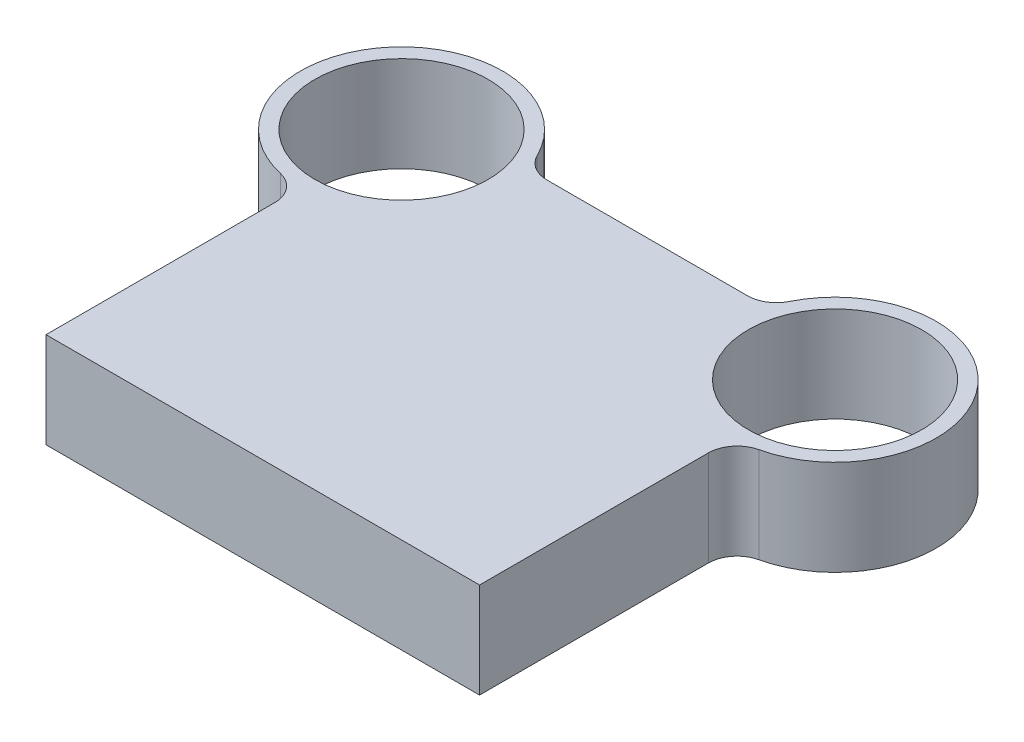
ISO-10303-21;
HEADER;
FILE_DESCRIPTION(('STEP AP214'),'2;1');
FILE_NAME('part.step','',(''),(''),'','','');
FILE_SCHEMA(('AUTOMOTIVE_DESIGN { 1 0 10303 214 1 1 1 1 }'));
ENDSEC;
DATA;
#1=APPLICATION_CONTEXT('core data for automotive mechanical design processes');
#2=APPLICATION_PROTOCOL_DEFINITION('international standard','automotive_design',2000,#1);
#3=PRODUCT_CONTEXT('',#1,'mechanical');
#4=PRODUCT('Part','Part','',(#3));
#5=PRODUCT_RELATED_PRODUCT_CATEGORY('part','',(#4));
#6=PRODUCT_DEFINITION_FORMATION('','',#4);
#7=PRODUCT_DEFINITION_CONTEXT('part definition',#1,'design');
#8=PRODUCT_DEFINITION('design','',#6,#7);
#9=PRODUCT_DEFINITION_SHAPE('','',#8);
#10=(LENGTH_UNIT() NAMED_UNIT(*) SI_UNIT(.MILLI.,.METRE.));
#11=(NAMED_UNIT(*) PLANE_ANGLE_UNIT() SI_UNIT($,.RADIAN.));
#12=(NAMED_UNIT(*) SI_UNIT($,.STERADIAN.) SOLID_ANGLE_UNIT());
#13=UNCERTAINTY_MEASURE_WITH_UNIT(LENGTH_MEASURE(1.E-05),#10,'distance_accuracy_value','');
#14=(GEOMETRIC_REPRESENTATION_CONTEXT(3) GLOBAL_UNCERTAINTY_ASSIGNED_CONTEXT((#13)) GLOBAL_UNIT_ASSIGNED_CONTEXT((#10,
#11,#12)) REPRESENTATION_CONTEXT('',''));
#15=CARTESIAN_POINT('',(0.,0.,0.));
#16=DIRECTION('',(0.,0.,1.));
#17=DIRECTION('',(1.,0.,0.));
#18=AXIS2_PLACEMENT_3D('',#15,#16,#17);
#19=CARTESIAN_POINT('',(-75.,33.,-123.));
#20=DIRECTION('',(0.,1.,0.));
#21=DIRECTION('',(0.,0.,1.));
#22=AXIS2_PLACEMENT_3D('',#19,#20,#21);
#23=PLANE('',#22);
#24=CARTESIAN_POINT('',(-75.,33.,-123.));
#25=DIRECTION('',(0.,1.,0.));
#26=DIRECTION('',(0.,0.,1.));
#27=AXIS2_PLACEMENT_3D('',#24,#25,#26);
#28=CIRCLE('',#27,30.);
#29=CARTESIAN_POINT('',(-75.,33.,-93.));
#30=VERTEX_POINT('',#29);
#31=EDGE_CURVE('E241',#30,#30,#28,.T.);
#32=ORIENTED_EDGE('',*,*,#31,.F.);
#33=EDGE_LOOP('',(#32));
#34=FACE_BOUND('',#33,.T.);
#35=CARTESIAN_POINT('',(-75.,33.,-123.));
#36=DIRECTION('',(0.,1.,0.));
#37=DIRECTION('',(0.,0.,1.));
#38=AXIS2_PLACEMENT_3D('',#35,#36,#37);
#39=CIRCLE('',#38,35.);
#40=CARTESIAN_POINT('',(-43.6467754232834,33.,-138.555555555556));
#41=VERTEX_POINT('',#40);
#42=CARTESIAN_POINT('',(-82.7777777777778,33.,-88.8751384934751));
#43=VERTEX_POINT('',#42);
#44=EDGE_CURVE('E133',#41,#43,#39,.T.);
#45=ORIENTED_EDGE('',*,*,#44,.T.);
#46=CARTESIAN_POINT('',(-85.,33.,-79.1251780630394));
#47=DIRECTION('',(0.,1.,0.));
#48=DIRECTION('',(0.,0.,1.));
#49=AXIS2_PLACEMENT_3D('',#46,#47,#48);
#50=CIRCLE('',#49,10.);
#51=CARTESIAN_POINT('',(-75.,33.,-79.1251780630394));
#52=VERTEX_POINT('',#51);
#53=EDGE_CURVE('E11',#43,#52,#50,.F.);
#54=ORIENTED_EDGE('',*,*,#53,.T.);
#55=DIRECTION('',(0.,0.,1.));
#56=VECTOR('',#55,1.);
#57=CARTESIAN_POINT('',(-75.,33.,0.));
#58=LINE('',#57,#56);
#59=CARTESIAN_POINT('',(-75.,33.,0.));
#60=VERTEX_POINT('',#59);
#61=EDGE_CURVE('E106',#52,#60,#58,.T.);
#62=ORIENTED_EDGE('',*,*,#61,.T.);
#63=DIRECTION('',(1.,0.,0.));
#64=VECTOR('',#63,1.);
#65=CARTESIAN_POINT('',(75.,33.,0.));
#66=LINE('',#65,#64);
#67=CARTESIAN_POINT('',(75.,33.,0.));
#68=VERTEX_POINT('',#67);
#69=EDGE_CURVE('E110',#60,#68,#66,.T.);
#70=ORIENTED_EDGE('',*,*,#69,.T.);
#71=DIRECTION('',(0.,0.,-1.));
#72=VECTOR('',#71,1.);
#73=CARTESIAN_POINT('',(75.,33.,0.));
#74=LINE('',#73,#72);
#75=CARTESIAN_POINT('',(75.,33.,-79.1251780630394));
#76=VERTEX_POINT('',#75);
#77=EDGE_CURVE('E123',#68,#76,#74,.T.);
#78=ORIENTED_EDGE('',*,*,#77,.T.);
#79=CARTESIAN_POINT('',(85.,33.,-79.1251780630394));
#80=DIRECTION('',(0.,1.,0.));
#81=DIRECTION('',(0.,0.,1.));
#82=AXIS2_PLACEMENT_3D('',#79,#80,#81);
#83=CIRCLE('',#82,10.);
#84=CARTESIAN_POINT('',(82.7777777777778,33.,-88.8751384934751));
#85=VERTEX_POINT('',#84);
#86=EDGE_CURVE('E155',#76,#85,#83,.F.);
#87=ORIENTED_EDGE('',*,*,#86,.T.);
#88=CARTESIAN_POINT('',(75.,33.,-123.));
#89=DIRECTION('',(0.,1.,0.));
#90=DIRECTION('',(0.,0.,-1.));
#91=AXIS2_PLACEMENT_3D('',#88,#89,#90);
#92=CIRCLE('',#91,35.);
#93=CARTESIAN_POINT('',(43.6467754232834,33.,-138.555555555556));
#94=VERTEX_POINT('',#93);
#95=EDGE_CURVE('E230',#85,#94,#92,.T.);
#96=ORIENTED_EDGE('',*,*,#95,.T.);
#97=CARTESIAN_POINT('',(34.6887112585073,33.,-143.));
#98=DIRECTION('',(0.,1.,0.));
#99=DIRECTION('',(0.,0.,1.));
#100=AXIS2_PLACEMENT_3D('',#97,#98,#99);
#101=CIRCLE('',#100,10.);
#102=CARTESIAN_POINT('',(34.6887112585073,33.,-133.));
#103=VERTEX_POINT('',#102);
#104=EDGE_CURVE('E159',#94,#103,#101,.F.);
#105=ORIENTED_EDGE('',*,*,#104,.T.);
#106=DIRECTION('',(-1.,0.,0.));
#107=VECTOR('',#106,1.);
#108=CARTESIAN_POINT('',(41.4589803375031,33.,-133.));
#109=LINE('',#108,#107);
#110=CARTESIAN_POINT('',(-34.6887112585072,33.,-133.));
#111=VERTEX_POINT('',#110);
#112=EDGE_CURVE('E227',#103,#111,#109,.T.);
#113=ORIENTED_EDGE('',*,*,#112,.T.);
#114=CARTESIAN_POINT('',(-34.6887112585073,33.,-143.));
#115=DIRECTION('',(0.,1.,0.));
#116=DIRECTION('',(0.,0.,1.));
#117=AXIS2_PLACEMENT_3D('',#114,#115,#116);
#118=CIRCLE('',#117,10.);
#119=EDGE_CURVE('E163',#111,#41,#118,.F.);
#120=ORIENTED_EDGE('',*,*,#119,.T.);
#121=EDGE_LOOP('',(#45,#54,#62,#70,#78,#87,#96,#105,#113,#120));
#122=FACE_BOUND('',#121,.T.);
#123=CARTESIAN_POINT('',(75.,33.,-123.));
#124=DIRECTION('',(0.,1.,0.));
#125=DIRECTION('',(0.,0.,-1.));
#126=AXIS2_PLACEMENT_3D('',#123,#124,#125);
#127=CIRCLE('',#126,30.);
#128=CARTESIAN_POINT('',(75.,33.,-153.));
#129=VERTEX_POINT('',#128);
#130=EDGE_CURVE('E258',#129,#129,#127,.T.);
#131=ORIENTED_EDGE('',*,*,#130,.F.);
#132=EDGE_LOOP('',(#131));
#133=FACE_BOUND('',#132,.T.);
#134=ADVANCED_FACE('F33',(#34,#122,#133),#23,.T.);
#135=CARTESIAN_POINT('',(-75.,0.,-123.));
#136=DIRECTION('',(0.,1.,0.));
#137=DIRECTION('',(0.,0.,1.));
#138=AXIS2_PLACEMENT_3D('',#135,#136,#137);
#139=PLANE('',#138);
#140=DIRECTION('',(0.,0.,1.));
#141=VECTOR('',#140,1.);
#142=CARTESIAN_POINT('',(-75.,0.,0.));
#143=LINE('',#142,#141);
#144=CARTESIAN_POINT('',(-75.,0.,-79.1251780630394));
#145=VERTEX_POINT('',#144);
#146=CARTESIAN_POINT('',(-75.,0.,0.));
#147=VERTEX_POINT('',#146);
#148=EDGE_CURVE('E127',#145,#147,#143,.T.);
#149=ORIENTED_EDGE('',*,*,#148,.F.);
#150=CARTESIAN_POINT('',(-85.,0.,-79.1251780630394));
#151=DIRECTION('',(0.,1.,0.));
#152=DIRECTION('',(0.,0.,1.));
#153=AXIS2_PLACEMENT_3D('',#150,#151,#152);
#154=CIRCLE('',#153,10.);
#155=CARTESIAN_POINT('',(-82.7777777777778,0.,-88.8751384934751));
#156=VERTEX_POINT('',#155);
#157=EDGE_CURVE('E41',#145,#156,#154,.T.);
#158=ORIENTED_EDGE('',*,*,#157,.T.);
#159=CARTESIAN_POINT('',(-75.,0.,-123.));
#160=DIRECTION('',(0.,1.,0.));
#161=DIRECTION('',(0.,0.,1.));
#162=AXIS2_PLACEMENT_3D('',#159,#160,#161);
#163=CIRCLE('',#162,35.);
#164=CARTESIAN_POINT('',(-43.6467754232834,0.,-138.555555555556));
#165=VERTEX_POINT('',#164);
#166=EDGE_CURVE('E114',#165,#156,#163,.T.);
#167=ORIENTED_EDGE('',*,*,#166,.F.);
#168=CARTESIAN_POINT('',(-34.6887112585073,0.,-143.));
#169=DIRECTION('',(0.,1.,0.));
#170=DIRECTION('',(0.,0.,1.));
#171=AXIS2_PLACEMENT_3D('',#168,#169,#170);
#172=CIRCLE('',#171,10.);
#173=CARTESIAN_POINT('',(-34.6887112585072,0.,-133.));
#174=VERTEX_POINT('',#173);
#175=EDGE_CURVE('E161',#165,#174,#172,.T.);
#176=ORIENTED_EDGE('',*,*,#175,.T.);
#177=DIRECTION('',(-1.,0.,0.));
#178=VECTOR('',#177,1.);
#179=CARTESIAN_POINT('',(41.4589803375031,0.,-133.));
#180=LINE('',#179,#178);
#181=CARTESIAN_POINT('',(34.6887112585073,0.,-133.));
#182=VERTEX_POINT('',#181);
#183=EDGE_CURVE('E173',#182,#174,#180,.T.);
#184=ORIENTED_EDGE('',*,*,#183,.F.);
#185=CARTESIAN_POINT('',(34.6887112585073,0.,-143.));
#186=DIRECTION('',(0.,1.,0.));
#187=DIRECTION('',(0.,0.,1.));
#188=AXIS2_PLACEMENT_3D('',#185,#186,#187);
#189=CIRCLE('',#188,10.);
#190=CARTESIAN_POINT('',(43.6467754232834,0.,-138.555555555556));
#191=VERTEX_POINT('',#190);
#192=EDGE_CURVE('E157',#182,#191,#189,.T.);
#193=ORIENTED_EDGE('',*,*,#192,.T.);
#194=CARTESIAN_POINT('',(75.,0.,-123.));
#195=DIRECTION('',(0.,1.,0.));
#196=DIRECTION('',(0.,0.,-1.));
#197=AXIS2_PLACEMENT_3D('',#194,#195,#196);
#198=CIRCLE('',#197,35.);
#199=CARTESIAN_POINT('',(82.7777777777778,0.,-88.8751384934751));
#200=VERTEX_POINT('',#199);
#201=EDGE_CURVE('E246',#200,#191,#198,.T.);
#202=ORIENTED_EDGE('',*,*,#201,.F.);
#203=CARTESIAN_POINT('',(85.,0.,-79.1251780630394));
#204=DIRECTION('',(0.,1.,0.));
#205=DIRECTION('',(0.,0.,1.));
#206=AXIS2_PLACEMENT_3D('',#203,#204,#205);
#207=CIRCLE('',#206,10.);
#208=CARTESIAN_POINT('',(75.,0.,-79.1251780630394));
#209=VERTEX_POINT('',#208);
#210=EDGE_CURVE('E153',#200,#209,#207,.T.);
#211=ORIENTED_EDGE('',*,*,#210,.T.);
#212=DIRECTION('',(0.,0.,-1.));
#213=VECTOR('',#212,1.);
#214=CARTESIAN_POINT('',(75.,0.,0.));
#215=LINE('',#214,#213);
#216=CARTESIAN_POINT('',(75.,0.,0.));
#217=VERTEX_POINT('',#216);
#218=EDGE_CURVE('E243',#217,#209,#215,.T.);
#219=ORIENTED_EDGE('',*,*,#218,.F.);
#220=DIRECTION('',(1.,0.,0.));
#221=VECTOR('',#220,1.);
#222=CARTESIAN_POINT('',(75.,0.,0.));
#223=LINE('',#222,#221);
#224=EDGE_CURVE('E240',#147,#217,#223,.T.);
#225=ORIENTED_EDGE('',*,*,#224,.F.);
#226=EDGE_LOOP('',(#149,#158,#167,#176,#184,#193,#202,#211,#219,#225));
#227=FACE_BOUND('',#226,.T.);
#228=CARTESIAN_POINT('',(-75.,0.,-123.));
#229=DIRECTION('',(0.,1.,0.));
#230=DIRECTION('',(0.,0.,1.));
#231=AXIS2_PLACEMENT_3D('',#228,#229,#230);
#232=CIRCLE('',#231,30.);
#233=CARTESIAN_POINT('',(-75.,0.,-93.));
#234=VERTEX_POINT('',#233);
#235=EDGE_CURVE('E255',#234,#234,#232,.T.);
#236=ORIENTED_EDGE('',*,*,#235,.T.);
#237=EDGE_LOOP('',(#236));
#238=FACE_BOUND('',#237,.T.);
#239=CARTESIAN_POINT('',(75.,0.,-123.));
#240=DIRECTION('',(0.,1.,0.));
#241=DIRECTION('',(0.,0.,-1.));
#242=AXIS2_PLACEMENT_3D('',#239,#240,#241);
#243=CIRCLE('',#242,30.);
#244=CARTESIAN_POINT('',(75.,0.,-153.));
#245=VERTEX_POINT('',#244);
#246=EDGE_CURVE('E261',#245,#245,#243,.T.);
#247=ORIENTED_EDGE('',*,*,#246,.T.);
#248=EDGE_LOOP('',(#247));
#249=FACE_BOUND('',#248,.T.);
#250=ADVANCED_FACE('F167',(#227,#238,#249),#139,.F.);
#251=CARTESIAN_POINT('',(-75.,33.,0.));
#252=DIRECTION('',(1.,0.,0.));
#253=DIRECTION('',(0.,0.,-1.));
#254=AXIS2_PLACEMENT_3D('',#251,#252,#253);
#255=PLANE('',#254);
#256=ORIENTED_EDGE('',*,*,#61,.F.);
#257=DIRECTION('',(0.,1.,0.));
#258=VECTOR('',#257,1.);
#259=CARTESIAN_POINT('',(-75.,0.,-79.1251780630394));
#260=LINE('',#259,#258);
#261=EDGE_CURVE('E151',#52,#145,#260,.F.);
#262=ORIENTED_EDGE('',*,*,#261,.T.);
#263=ORIENTED_EDGE('',*,*,#148,.T.);
#264=DIRECTION('',(0.,-1.,0.));
#265=VECTOR('',#264,1.);
#266=CARTESIAN_POINT('',(-75.,33.,0.));
#267=LINE('',#266,#265);
#268=EDGE_CURVE('E119',#60,#147,#267,.T.);
#269=ORIENTED_EDGE('',*,*,#268,.F.);
#270=EDGE_LOOP('',(#256,#262,#263,#269));
#271=FACE_BOUND('',#270,.T.);
#272=ADVANCED_FACE('F125',(#271),#255,.F.);
#273=CARTESIAN_POINT('',(75.,33.,0.));
#274=DIRECTION('',(0.,0.,-1.));
#275=DIRECTION('',(-1.,0.,0.));
#276=AXIS2_PLACEMENT_3D('',#273,#274,#275);
#277=PLANE('',#276);
#278=ORIENTED_EDGE('',*,*,#224,.T.);
#279=DIRECTION('',(0.,-1.,0.));
#280=VECTOR('',#279,1.);
#281=CARTESIAN_POINT('',(75.,33.,0.));
#282=LINE('',#281,#280);
#283=EDGE_CURVE('E121',#68,#217,#282,.T.);
#284=ORIENTED_EDGE('',*,*,#283,.F.);
#285=ORIENTED_EDGE('',*,*,#69,.F.);
#286=ORIENTED_EDGE('',*,*,#268,.T.);
#287=EDGE_LOOP('',(#278,#284,#285,#286));
#288=FACE_BOUND('',#287,.T.);
#289=ADVANCED_FACE('F118',(#288),#277,.F.);
#290=CARTESIAN_POINT('',(75.,33.,0.));
#291=DIRECTION('',(-1.,0.,0.));
#292=DIRECTION('',(0.,0.,1.));
#293=AXIS2_PLACEMENT_3D('',#290,#291,#292);
#294=PLANE('',#293);
#295=ORIENTED_EDGE('',*,*,#218,.T.);
#296=DIRECTION('',(0.,1.,0.));
#297=VECTOR('',#296,1.);
#298=CARTESIAN_POINT('',(75.,33.,-79.1251780630394));
#299=LINE('',#298,#297);
#300=EDGE_CURVE('E139',#209,#76,#299,.T.);
#301=ORIENTED_EDGE('',*,*,#300,.T.);
#302=ORIENTED_EDGE('',*,*,#77,.F.);
#303=ORIENTED_EDGE('',*,*,#283,.T.);
#304=EDGE_LOOP('',(#295,#301,#302,#303));
#305=FACE_BOUND('',#304,.T.);
#306=ADVANCED_FACE('F203',(#305),#294,.F.);
#307=CARTESIAN_POINT('',(75.,33.,-123.));
#308=DIRECTION('',(0.,-1.,0.));
#309=DIRECTION('',(0.,0.,-1.));
#310=AXIS2_PLACEMENT_3D('',#307,#308,#309);
#311=CYLINDRICAL_SURFACE('',#310,35.);
#312=ORIENTED_EDGE('',*,*,#95,.F.);
#313=DIRECTION('',(0.,-1.,0.));
#314=VECTOR('',#313,1.);
#315=CARTESIAN_POINT('',(82.7777777777778,33.,-88.8751384934751));
#316=LINE('',#315,#314);
#317=EDGE_CURVE('E131',#85,#200,#316,.T.);
#318=ORIENTED_EDGE('',*,*,#317,.T.);
#319=ORIENTED_EDGE('',*,*,#201,.T.);
#320=DIRECTION('',(0.,-1.,0.));
#321=VECTOR('',#320,1.);
#322=CARTESIAN_POINT('',(43.6467754232834,33.,-138.555555555556));
#323=LINE('',#322,#321);
#324=EDGE_CURVE('E129',#191,#94,#323,.F.);
#325=ORIENTED_EDGE('',*,*,#324,.T.);
#326=EDGE_LOOP('',(#312,#318,#319,#325));
#327=FACE_BOUND('',#326,.T.);
#328=ADVANCED_FACE('F199',(#327),#311,.T.);
#329=CARTESIAN_POINT('',(41.4589803375031,33.,-133.));
#330=DIRECTION('',(0.,0.,1.));
#331=DIRECTION('',(1.,0.,0.));
#332=AXIS2_PLACEMENT_3D('',#329,#330,#331);
#333=PLANE('',#332);
#334=ORIENTED_EDGE('',*,*,#112,.F.);
#335=DIRECTION('',(0.,1.,0.));
#336=VECTOR('',#335,1.);
#337=CARTESIAN_POINT('',(34.6887112585073,0.,-133.));
#338=LINE('',#337,#336);
#339=EDGE_CURVE('E143',#103,#182,#338,.F.);
#340=ORIENTED_EDGE('',*,*,#339,.T.);
#341=ORIENTED_EDGE('',*,*,#183,.T.);
#342=DIRECTION('',(0.,1.,0.));
#343=VECTOR('',#342,1.);
#344=CARTESIAN_POINT('',(-34.6887112585073,33.,-133.));
#345=LINE('',#344,#343);
#346=EDGE_CURVE('E141',#174,#111,#345,.T.);
#347=ORIENTED_EDGE('',*,*,#346,.T.);
#348=EDGE_LOOP('',(#334,#340,#341,#347));
#349=FACE_BOUND('',#348,.T.);
#350=ADVANCED_FACE('F196',(#349),#333,.F.);
#351=CARTESIAN_POINT('',(-75.,33.,-123.));
#352=DIRECTION('',(0.,-1.,0.));
#353=DIRECTION('',(0.,0.,-1.));
#354=AXIS2_PLACEMENT_3D('',#351,#352,#353);
#355=CYLINDRICAL_SURFACE('',#354,35.);
#356=ORIENTED_EDGE('',*,*,#44,.F.);
#357=DIRECTION('',(0.,-1.,0.));
#358=VECTOR('',#357,1.);
#359=CARTESIAN_POINT('',(-43.6467754232834,33.,-138.555555555556));
#360=LINE('',#359,#358);
#361=EDGE_CURVE('E148',#41,#165,#360,.T.);
#362=ORIENTED_EDGE('',*,*,#361,.T.);
#363=ORIENTED_EDGE('',*,*,#166,.T.);
#364=DIRECTION('',(0.,-1.,0.));
#365=VECTOR('',#364,1.);
#366=CARTESIAN_POINT('',(-82.7777777777778,33.,-88.8751384934751));
#367=LINE('',#366,#365);
#368=EDGE_CURVE('E146',#156,#43,#367,.F.);
#369=ORIENTED_EDGE('',*,*,#368,.T.);
#370=EDGE_LOOP('',(#356,#362,#363,#369));
#371=FACE_BOUND('',#370,.T.);
#372=ADVANCED_FACE('F171',(#371),#355,.T.);
#373=CARTESIAN_POINT('',(-75.,33.,-123.));
#374=DIRECTION('',(0.,-1.,0.));
#375=DIRECTION('',(0.,0.,-1.));
#376=AXIS2_PLACEMENT_3D('',#373,#374,#375);
#377=CYLINDRICAL_SURFACE('',#376,30.);
#378=ORIENTED_EDGE('',*,*,#31,.T.);
#379=EDGE_LOOP('',(#378));
#380=FACE_BOUND('',#379,.T.);
#381=ORIENTED_EDGE('',*,*,#235,.F.);
#382=EDGE_LOOP('',(#381));
#383=FACE_BOUND('',#382,.T.);
#384=ADVANCED_FACE('F191',(#380,#383),#377,.F.);
#385=CARTESIAN_POINT('',(75.,33.,-123.));
#386=DIRECTION('',(0.,-1.,0.));
#387=DIRECTION('',(0.,0.,-1.));
#388=AXIS2_PLACEMENT_3D('',#385,#386,#387);
#389=CYLINDRICAL_SURFACE('',#388,30.);
#390=ORIENTED_EDGE('',*,*,#130,.T.);
#391=EDGE_LOOP('',(#390));
#392=FACE_BOUND('',#391,.T.);
#393=ORIENTED_EDGE('',*,*,#246,.F.);
#394=EDGE_LOOP('',(#393));
#395=FACE_BOUND('',#394,.T.);
#396=ADVANCED_FACE('F215',(#392,#395),#389,.F.);
#397=CARTESIAN_POINT('',(85.,33.,-79.1251780630394));
#398=DIRECTION('',(0.,-1.,0.));
#399=DIRECTION('',(0.,0.,-1.));
#400=AXIS2_PLACEMENT_3D('',#397,#398,#399);
#401=CYLINDRICAL_SURFACE('',#400,10.);
#402=ORIENTED_EDGE('',*,*,#86,.F.);
#403=ORIENTED_EDGE('',*,*,#300,.F.);
#404=ORIENTED_EDGE('',*,*,#210,.F.);
#405=ORIENTED_EDGE('',*,*,#317,.F.);
#406=EDGE_LOOP('',(#402,#403,#404,#405));
#407=FACE_BOUND('',#406,.T.);
#408=ADVANCED_FACE('F212',(#407),#401,.F.);
#409=CARTESIAN_POINT('',(34.6887112585073,33.,-143.));
#410=DIRECTION('',(0.,-1.,0.));
#411=DIRECTION('',(0.,0.,-1.));
#412=AXIS2_PLACEMENT_3D('',#409,#410,#411);
#413=CYLINDRICAL_SURFACE('',#412,10.);
#414=ORIENTED_EDGE('',*,*,#104,.F.);
#415=ORIENTED_EDGE('',*,*,#324,.F.);
#416=ORIENTED_EDGE('',*,*,#192,.F.);
#417=ORIENTED_EDGE('',*,*,#339,.F.);
#418=EDGE_LOOP('',(#414,#415,#416,#417));
#419=FACE_BOUND('',#418,.T.);
#420=ADVANCED_FACE('F179',(#419),#413,.F.);
#421=CARTESIAN_POINT('',(-34.6887112585073,33.,-143.));
#422=DIRECTION('',(0.,-1.,0.));
#423=DIRECTION('',(0.,0.,-1.));
#424=AXIS2_PLACEMENT_3D('',#421,#422,#423);
#425=CYLINDRICAL_SURFACE('',#424,10.);
#426=ORIENTED_EDGE('',*,*,#119,.F.);
#427=ORIENTED_EDGE('',*,*,#346,.F.);
#428=ORIENTED_EDGE('',*,*,#175,.F.);
#429=ORIENTED_EDGE('',*,*,#361,.F.);
#430=EDGE_LOOP('',(#426,#427,#428,#429));
#431=FACE_BOUND('',#430,.T.);
#432=ADVANCED_FACE('F175',(#431),#425,.F.);
#433=CARTESIAN_POINT('',(-85.,33.,-79.1251780630394));
#434=DIRECTION('',(0.,-1.,0.));
#435=DIRECTION('',(0.,0.,-1.));
#436=AXIS2_PLACEMENT_3D('',#433,#434,#435);
#437=CYLINDRICAL_SURFACE('',#436,10.);
#438=ORIENTED_EDGE('',*,*,#53,.F.);
#439=ORIENTED_EDGE('',*,*,#368,.F.);
#440=ORIENTED_EDGE('',*,*,#157,.F.);
#441=ORIENTED_EDGE('',*,*,#261,.F.);
#442=EDGE_LOOP('',(#438,#439,#440,#441));
#443=FACE_BOUND('',#442,.T.);
#444=ADVANCED_FACE('F35',(#443),#437,.F.);
#445=CLOSED_SHELL('',(#134,#250,#272,#289,#306,#328,#350,#372,#384,#396,#408,#420,#432,#444));
#446=MANIFOLD_SOLID_BREP('B2',#445);
#447=ADVANCED_BREP_SHAPE_REPRESENTATION('',(#18,#446),#14);
#448=SHAPE_DEFINITION_REPRESENTATION(#9,#447);
ENDSEC;
END-ISO-10303-21;
